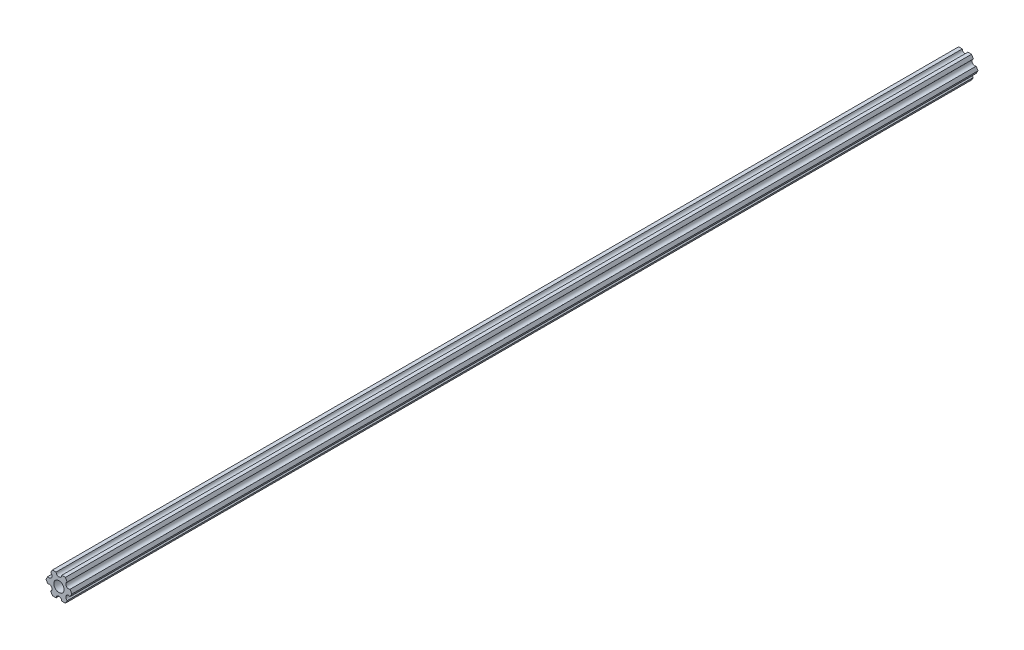
ISO-10303-21;
HEADER;
FILE_DESCRIPTION(('STEP AP214'),'2;1');
FILE_NAME('part.step','',(''),(''),'','','');
FILE_SCHEMA(('AUTOMOTIVE_DESIGN { 1 0 10303 214 1 1 1 1 }'));
ENDSEC;
DATA;
#1=APPLICATION_CONTEXT('core data for automotive mechanical design processes');
#2=APPLICATION_PROTOCOL_DEFINITION('international standard','automotive_design',2000,#1);
#3=PRODUCT_CONTEXT('',#1,'mechanical');
#4=PRODUCT('Part','Part','',(#3));
#5=PRODUCT_RELATED_PRODUCT_CATEGORY('part','',(#4));
#6=PRODUCT_DEFINITION_FORMATION('','',#4);
#7=PRODUCT_DEFINITION_CONTEXT('part definition',#1,'design');
#8=PRODUCT_DEFINITION('design','',#6,#7);
#9=PRODUCT_DEFINITION_SHAPE('','',#8);
#10=(LENGTH_UNIT() NAMED_UNIT(*) SI_UNIT(.MILLI.,.METRE.));
#11=(NAMED_UNIT(*) PLANE_ANGLE_UNIT() SI_UNIT($,.RADIAN.));
#12=(NAMED_UNIT(*) SI_UNIT($,.STERADIAN.) SOLID_ANGLE_UNIT());
#13=UNCERTAINTY_MEASURE_WITH_UNIT(LENGTH_MEASURE(1.E-05),#10,'distance_accuracy_value','');
#14=(GEOMETRIC_REPRESENTATION_CONTEXT(3) GLOBAL_UNCERTAINTY_ASSIGNED_CONTEXT((#13)) GLOBAL_UNIT_ASSIGNED_CONTEXT((#10,
#11,#12)) REPRESENTATION_CONTEXT('',''));
#15=CARTESIAN_POINT('',(0.,0.,0.));
#16=DIRECTION('',(0.,0.,1.));
#17=DIRECTION('',(1.,0.,0.));
#18=AXIS2_PLACEMENT_3D('',#15,#16,#17);
#19=CARTESIAN_POINT('',(5.49926112168156,3.17500033315933,514.35));
#20=DIRECTION('',(0.,0.,1.));
#21=DIRECTION('',(1.,0.,0.));
#22=AXIS2_PLACEMENT_3D('',#19,#20,#21);
#23=PLANE('',#22);
#24=DIRECTION('',(0.499999947533953,0.866025434075723,0.));
#25=VECTOR('',#24,1.);
#26=CARTESIAN_POINT('',(6.29301142309098,-1.80018429024546,514.35));
#27=LINE('',#26,#25);
#28=CARTESIAN_POINT('',(6.29301142309098,-1.80018429024546,514.35));
#29=VERTEX_POINT('',#28);
#30=CARTESIAN_POINT('',(7.33234841870826,4.44212519169686E-07,514.35));
#31=VERTEX_POINT('',#30);
#32=EDGE_CURVE('E229',#29,#31,#27,.T.);
#33=ORIENTED_EDGE('',*,*,#32,.T.);
#34=DIRECTION('',(-0.500000052466056,0.866025373493145,0.));
#35=VECTOR('',#34,1.);
#36=CARTESIAN_POINT('',(7.33234841870826,4.44212519169686E-07,514.35));
#37=LINE('',#36,#35);
#38=CARTESIAN_POINT('',(6.29301120497139,1.80018505273894,514.35));
#39=VERTEX_POINT('',#38);
#40=EDGE_CURVE('E127',#31,#39,#37,.T.);
#41=ORIENTED_EDGE('',*,*,#40,.T.);
#42=CARTESIAN_POINT('',(5.49926112168156,3.17500033315933,514.35));
#43=DIRECTION('',(0.,0.,-1.));
#44=DIRECTION('',(1.,0.,0.));
#45=AXIS2_PLACEMENT_3D('',#42,#43,#44);
#46=CIRCLE('',#45,1.5875);
#47=CARTESIAN_POINT('',(4.70551103839172,4.54981561357972,514.35));
#48=VERTEX_POINT('',#47);
#49=EDGE_CURVE('E274',#39,#48,#46,.T.);
#50=ORIENTED_EDGE('',*,*,#49,.T.);
#51=DIRECTION('',(-0.500000052466046,0.866025373493151,0.));
#52=VECTOR('',#51,1.);
#53=CARTESIAN_POINT('',(4.70551103839172,4.54981561357972,514.35));
#54=LINE('',#53,#52);
#55=CARTESIAN_POINT('',(3.66617382465481,6.35000022210627,514.35));
#56=VERTEX_POINT('',#55);
#57=EDGE_CURVE('E293',#48,#56,#54,.T.);
#58=ORIENTED_EDGE('',*,*,#57,.T.);
#59=DIRECTION('',(-0.999999999999998,-6.05825850611185E-08,0.));
#60=VECTOR('',#59,1.);
#61=CARTESIAN_POINT('',(3.66617382465481,6.35000022210627,514.35));
#62=LINE('',#61,#60);
#63=CARTESIAN_POINT('',(1.58749961530074,6.35000009617482,514.35));
#64=VERTEX_POINT('',#63);
#65=EDGE_CURVE('E290',#56,#64,#62,.T.);
#66=ORIENTED_EDGE('',*,*,#65,.T.);
#67=CARTESIAN_POINT('',(-3.84699260060323E-07,6.35,514.35));
#68=DIRECTION('',(0.,0.,-1.));
#69=DIRECTION('',(1.,0.,0.));
#70=AXIS2_PLACEMENT_3D('',#67,#68,#69);
#71=CIRCLE('',#70,1.5875);
#72=CARTESIAN_POINT('',(-1.58750038469926,6.34999990382518,514.35));
#73=VERTEX_POINT('',#72);
#74=EDGE_CURVE('E292',#64,#73,#71,.T.);
#75=ORIENTED_EDGE('',*,*,#74,.T.);
#76=DIRECTION('',(-0.999999999999998,-6.05825963273174E-08,0.));
#77=VECTOR('',#76,1.);
#78=CARTESIAN_POINT('',(-1.58750038469926,6.34999990382518,514.35));
#79=LINE('',#78,#77);
#80=CARTESIAN_POINT('',(-3.66617459405349,6.3499997778937,514.35));
#81=VERTEX_POINT('',#80);
#82=EDGE_CURVE('E295',#73,#81,#79,.T.);
#83=ORIENTED_EDGE('',*,*,#82,.T.);
#84=DIRECTION('',(-0.499999947533942,-0.866025434075729,0.));
#85=VECTOR('',#84,1.);
#86=CARTESIAN_POINT('',(-3.66617459405349,6.3499997778937,514.35));
#87=LINE('',#86,#85);
#88=CARTESIAN_POINT('',(-4.70551158967065,4.54981504343587,514.35));
#89=VERTEX_POINT('',#88);
#90=EDGE_CURVE('E301',#81,#89,#87,.T.);
#91=ORIENTED_EDGE('',*,*,#90,.T.);
#92=CARTESIAN_POINT('',(-5.49926150638082,3.17499966684067,514.35));
#93=DIRECTION('',(0.,0.,-1.));
#94=DIRECTION('',(1.,0.,0.));
#95=AXIS2_PLACEMENT_3D('',#92,#93,#94);
#96=CIRCLE('',#95,1.5875);
#97=CARTESIAN_POINT('',(-6.29301142309098,1.80018429024547,514.35));
#98=VERTEX_POINT('',#97);
#99=EDGE_CURVE('E303',#89,#98,#96,.T.);
#100=ORIENTED_EDGE('',*,*,#99,.T.);
#101=DIRECTION('',(-0.499999947533951,-0.866025434075724,0.));
#102=VECTOR('',#101,1.);
#103=CARTESIAN_POINT('',(-6.29301142309098,1.80018429024547,514.35));
#104=LINE('',#103,#102);
#105=CARTESIAN_POINT('',(-7.33234841870826,-4.44212523790841E-07,514.35));
#106=VERTEX_POINT('',#105);
#107=EDGE_CURVE('E305',#98,#106,#104,.T.);
#108=ORIENTED_EDGE('',*,*,#107,.T.);
#109=DIRECTION('',(0.500000052466045,-0.866025373493151,0.));
#110=VECTOR('',#109,1.);
#111=CARTESIAN_POINT('',(-7.33234841870826,-4.44212523790841E-07,514.35));
#112=LINE('',#111,#110);
#113=CARTESIAN_POINT('',(-6.29301120497141,-1.80018505273897,514.35));
#114=VERTEX_POINT('',#113);
#115=EDGE_CURVE('E307',#106,#114,#112,.T.);
#116=ORIENTED_EDGE('',*,*,#115,.T.);
#117=CARTESIAN_POINT('',(-5.49926112168156,-3.17500033315934,514.35));
#118=DIRECTION('',(0.,0.,-1.));
#119=DIRECTION('',(1.,0.,0.));
#120=AXIS2_PLACEMENT_3D('',#117,#118,#119);
#121=CIRCLE('',#120,1.5875);
#122=CARTESIAN_POINT('',(-4.70551103839172,-4.54981561357972,514.35));
#123=VERTEX_POINT('',#122);
#124=EDGE_CURVE('E309',#114,#123,#121,.T.);
#125=ORIENTED_EDGE('',*,*,#124,.T.);
#126=DIRECTION('',(0.500000052466045,-0.866025373493151,0.));
#127=VECTOR('',#126,1.);
#128=CARTESIAN_POINT('',(-4.70551103839172,-4.54981561357972,514.35));
#129=LINE('',#128,#127);
#130=CARTESIAN_POINT('',(-3.66617382465481,-6.35000022210628,514.35));
#131=VERTEX_POINT('',#130);
#132=EDGE_CURVE('E311',#123,#131,#129,.T.);
#133=ORIENTED_EDGE('',*,*,#132,.T.);
#134=DIRECTION('',(0.999999999999998,6.05825854783851E-08,0.));
#135=VECTOR('',#134,1.);
#136=CARTESIAN_POINT('',(-3.66617382465481,-6.35000022210628,514.35));
#137=LINE('',#136,#135);
#138=CARTESIAN_POINT('',(-1.58749961530074,-6.35000009617482,514.35));
#139=VERTEX_POINT('',#138);
#140=EDGE_CURVE('E313',#131,#139,#137,.T.);
#141=ORIENTED_EDGE('',*,*,#140,.T.);
#142=CARTESIAN_POINT('',(3.8469926204343E-07,-6.35,514.35));
#143=DIRECTION('',(0.,0.,-1.));
#144=DIRECTION('',(1.,0.,0.));
#145=AXIS2_PLACEMENT_3D('',#142,#143,#144);
#146=CIRCLE('',#145,1.5875);
#147=CARTESIAN_POINT('',(1.58750038469926,-6.34999990382518,514.35));
#148=VERTEX_POINT('',#147);
#149=EDGE_CURVE('E176',#139,#148,#146,.T.);
#150=ORIENTED_EDGE('',*,*,#149,.T.);
#151=DIRECTION('',(0.999999999999998,6.05825721258438E-08,0.));
#152=VECTOR('',#151,1.);
#153=CARTESIAN_POINT('',(1.58750038469926,-6.34999990382518,514.35));
#154=LINE('',#153,#152);
#155=CARTESIAN_POINT('',(3.66617459405346,-6.34999977789375,514.35));
#156=VERTEX_POINT('',#155);
#157=EDGE_CURVE('E170',#148,#156,#154,.T.);
#158=ORIENTED_EDGE('',*,*,#157,.T.);
#159=DIRECTION('',(0.499999947533941,0.86602543407573,0.));
#160=VECTOR('',#159,1.);
#161=CARTESIAN_POINT('',(3.66617459405346,-6.34999977789375,514.35));
#162=LINE('',#161,#160);
#163=CARTESIAN_POINT('',(4.70551158967065,-4.54981504343587,514.35));
#164=VERTEX_POINT('',#163);
#165=EDGE_CURVE('E174',#156,#164,#162,.T.);
#166=ORIENTED_EDGE('',*,*,#165,.T.);
#167=CARTESIAN_POINT('',(5.49926150638082,-3.17499966684067,514.35));
#168=DIRECTION('',(0.,0.,-1.));
#169=DIRECTION('',(1.,0.,0.));
#170=AXIS2_PLACEMENT_3D('',#167,#168,#169);
#171=CIRCLE('',#170,1.58750000000001);
#172=EDGE_CURVE('E54',#164,#29,#171,.T.);
#173=ORIENTED_EDGE('',*,*,#172,.T.);
#174=EDGE_LOOP('',(#33,#41,#50,#58,#66,#75,#83,#91,#100,#108,#116,#125,#133,#141,#150,#158,#166,#173));
#175=FACE_BOUND('',#174,.T.);
#176=CARTESIAN_POINT('',(0.,0.,514.35));
#177=DIRECTION('',(0.,0.,1.));
#178=DIRECTION('',(1.,0.,0.));
#179=AXIS2_PLACEMENT_3D('',#176,#177,#178);
#180=CIRCLE('',#179,2.9337);
#181=CARTESIAN_POINT('',(2.9337,0.,514.35));
#182=VERTEX_POINT('',#181);
#183=EDGE_CURVE('E198',#182,#182,#180,.T.);
#184=ORIENTED_EDGE('',*,*,#183,.F.);
#185=EDGE_LOOP('',(#184));
#186=FACE_BOUND('',#185,.T.);
#187=ADVANCED_FACE('F37',(#175,#186),#23,.T.);
#188=CARTESIAN_POINT('',(5.49926112168156,3.17500033315933,0.));
#189=DIRECTION('',(0.,0.,1.));
#190=DIRECTION('',(1.,0.,0.));
#191=AXIS2_PLACEMENT_3D('',#188,#189,#190);
#192=PLANE('',#191);
#193=DIRECTION('',(0.499999947533953,0.866025434075723,0.));
#194=VECTOR('',#193,1.);
#195=CARTESIAN_POINT('',(6.29301142309098,-1.80018429024546,0.));
#196=LINE('',#195,#194);
#197=CARTESIAN_POINT('',(6.29301142309098,-1.80018429024546,0.));
#198=VERTEX_POINT('',#197);
#199=CARTESIAN_POINT('',(7.33234841870826,4.44212519169686E-07,0.));
#200=VERTEX_POINT('',#199);
#201=EDGE_CURVE('E194',#198,#200,#196,.T.);
#202=ORIENTED_EDGE('',*,*,#201,.F.);
#203=CARTESIAN_POINT('',(5.49926150638082,-3.17499966684067,0.));
#204=DIRECTION('',(0.,0.,-1.));
#205=DIRECTION('',(1.,0.,0.));
#206=AXIS2_PLACEMENT_3D('',#203,#204,#205);
#207=CIRCLE('',#206,1.58750000000001);
#208=CARTESIAN_POINT('',(4.70551158967065,-4.54981504343587,0.));
#209=VERTEX_POINT('',#208);
#210=EDGE_CURVE('E119',#209,#198,#207,.T.);
#211=ORIENTED_EDGE('',*,*,#210,.F.);
#212=DIRECTION('',(0.499999947533941,0.86602543407573,0.));
#213=VECTOR('',#212,1.);
#214=CARTESIAN_POINT('',(3.66617459405346,-6.34999977789375,0.));
#215=LINE('',#214,#213);
#216=CARTESIAN_POINT('',(3.66617459405346,-6.34999977789375,0.));
#217=VERTEX_POINT('',#216);
#218=EDGE_CURVE('E113',#217,#209,#215,.T.);
#219=ORIENTED_EDGE('',*,*,#218,.F.);
#220=DIRECTION('',(0.999999999999998,6.05825721258438E-08,0.));
#221=VECTOR('',#220,1.);
#222=CARTESIAN_POINT('',(1.58750038469926,-6.34999990382518,0.));
#223=LINE('',#222,#221);
#224=CARTESIAN_POINT('',(1.58750038469926,-6.34999990382518,0.));
#225=VERTEX_POINT('',#224);
#226=EDGE_CURVE('E184',#225,#217,#223,.T.);
#227=ORIENTED_EDGE('',*,*,#226,.F.);
#228=CARTESIAN_POINT('',(3.8469926204343E-07,-6.35,0.));
#229=DIRECTION('',(0.,0.,-1.));
#230=DIRECTION('',(1.,0.,0.));
#231=AXIS2_PLACEMENT_3D('',#228,#229,#230);
#232=CIRCLE('',#231,1.5875);
#233=CARTESIAN_POINT('',(-1.58749961530074,-6.35000009617482,0.));
#234=VERTEX_POINT('',#233);
#235=EDGE_CURVE('E224',#234,#225,#232,.T.);
#236=ORIENTED_EDGE('',*,*,#235,.F.);
#237=DIRECTION('',(0.999999999999998,6.05825854783851E-08,0.));
#238=VECTOR('',#237,1.);
#239=CARTESIAN_POINT('',(-3.66617382465481,-6.35000022210628,0.));
#240=LINE('',#239,#238);
#241=CARTESIAN_POINT('',(-3.66617382465481,-6.35000022210628,0.));
#242=VERTEX_POINT('',#241);
#243=EDGE_CURVE('E222',#242,#234,#240,.T.);
#244=ORIENTED_EDGE('',*,*,#243,.F.);
#245=DIRECTION('',(0.500000052466045,-0.866025373493151,0.));
#246=VECTOR('',#245,1.);
#247=CARTESIAN_POINT('',(-4.70551103839172,-4.54981561357972,0.));
#248=LINE('',#247,#246);
#249=CARTESIAN_POINT('',(-4.70551103839172,-4.54981561357972,0.));
#250=VERTEX_POINT('',#249);
#251=EDGE_CURVE('E220',#250,#242,#248,.T.);
#252=ORIENTED_EDGE('',*,*,#251,.F.);
#253=CARTESIAN_POINT('',(-5.49926112168156,-3.17500033315934,0.));
#254=DIRECTION('',(0.,0.,-1.));
#255=DIRECTION('',(1.,0.,0.));
#256=AXIS2_PLACEMENT_3D('',#253,#254,#255);
#257=CIRCLE('',#256,1.5875);
#258=CARTESIAN_POINT('',(-6.29301120497141,-1.80018505273897,0.));
#259=VERTEX_POINT('',#258);
#260=EDGE_CURVE('E218',#259,#250,#257,.T.);
#261=ORIENTED_EDGE('',*,*,#260,.F.);
#262=DIRECTION('',(0.500000052466045,-0.866025373493151,0.));
#263=VECTOR('',#262,1.);
#264=CARTESIAN_POINT('',(-7.33234841870826,-4.44212523790841E-07,0.));
#265=LINE('',#264,#263);
#266=CARTESIAN_POINT('',(-7.33234841870826,-4.44212523790841E-07,0.));
#267=VERTEX_POINT('',#266);
#268=EDGE_CURVE('E216',#267,#259,#265,.T.);
#269=ORIENTED_EDGE('',*,*,#268,.F.);
#270=DIRECTION('',(-0.499999947533951,-0.866025434075724,0.));
#271=VECTOR('',#270,1.);
#272=CARTESIAN_POINT('',(-6.29301142309098,1.80018429024547,0.));
#273=LINE('',#272,#271);
#274=CARTESIAN_POINT('',(-6.29301142309098,1.80018429024547,0.));
#275=VERTEX_POINT('',#274);
#276=EDGE_CURVE('E214',#275,#267,#273,.T.);
#277=ORIENTED_EDGE('',*,*,#276,.F.);
#278=CARTESIAN_POINT('',(-5.49926150638082,3.17499966684067,0.));
#279=DIRECTION('',(0.,0.,-1.));
#280=DIRECTION('',(1.,0.,0.));
#281=AXIS2_PLACEMENT_3D('',#278,#279,#280);
#282=CIRCLE('',#281,1.5875);
#283=CARTESIAN_POINT('',(-4.70551158967065,4.54981504343587,0.));
#284=VERTEX_POINT('',#283);
#285=EDGE_CURVE('E212',#284,#275,#282,.T.);
#286=ORIENTED_EDGE('',*,*,#285,.F.);
#287=DIRECTION('',(-0.499999947533942,-0.866025434075729,0.));
#288=VECTOR('',#287,1.);
#289=CARTESIAN_POINT('',(-3.66617459405349,6.3499997778937,0.));
#290=LINE('',#289,#288);
#291=CARTESIAN_POINT('',(-3.66617459405349,6.3499997778937,0.));
#292=VERTEX_POINT('',#291);
#293=EDGE_CURVE('E210',#292,#284,#290,.T.);
#294=ORIENTED_EDGE('',*,*,#293,.F.);
#295=DIRECTION('',(-0.999999999999998,-6.05825963273174E-08,0.));
#296=VECTOR('',#295,1.);
#297=CARTESIAN_POINT('',(-1.58750038469926,6.34999990382518,0.));
#298=LINE('',#297,#296);
#299=CARTESIAN_POINT('',(-1.58750038469926,6.34999990382518,0.));
#300=VERTEX_POINT('',#299);
#301=EDGE_CURVE('E208',#300,#292,#298,.T.);
#302=ORIENTED_EDGE('',*,*,#301,.F.);
#303=CARTESIAN_POINT('',(-3.84699260060323E-07,6.35,0.));
#304=DIRECTION('',(0.,0.,-1.));
#305=DIRECTION('',(1.,0.,0.));
#306=AXIS2_PLACEMENT_3D('',#303,#304,#305);
#307=CIRCLE('',#306,1.5875);
#308=CARTESIAN_POINT('',(1.58749961530074,6.35000009617482,0.));
#309=VERTEX_POINT('',#308);
#310=EDGE_CURVE('E206',#309,#300,#307,.T.);
#311=ORIENTED_EDGE('',*,*,#310,.F.);
#312=DIRECTION('',(-0.999999999999998,-6.05825850611185E-08,0.));
#313=VECTOR('',#312,1.);
#314=CARTESIAN_POINT('',(3.66617382465481,6.35000022210627,0.));
#315=LINE('',#314,#313);
#316=CARTESIAN_POINT('',(3.66617382465481,6.35000022210627,0.));
#317=VERTEX_POINT('',#316);
#318=EDGE_CURVE('E204',#317,#309,#315,.T.);
#319=ORIENTED_EDGE('',*,*,#318,.F.);
#320=DIRECTION('',(-0.500000052466046,0.866025373493151,0.));
#321=VECTOR('',#320,1.);
#322=CARTESIAN_POINT('',(4.70551103839172,4.54981561357972,0.));
#323=LINE('',#322,#321);
#324=CARTESIAN_POINT('',(4.70551103839172,4.54981561357972,0.));
#325=VERTEX_POINT('',#324);
#326=EDGE_CURVE('E202',#325,#317,#323,.T.);
#327=ORIENTED_EDGE('',*,*,#326,.F.);
#328=CARTESIAN_POINT('',(5.49926112168156,3.17500033315933,0.));
#329=DIRECTION('',(0.,0.,-1.));
#330=DIRECTION('',(1.,0.,0.));
#331=AXIS2_PLACEMENT_3D('',#328,#329,#330);
#332=CIRCLE('',#331,1.5875);
#333=CARTESIAN_POINT('',(6.29301120497139,1.80018505273894,0.));
#334=VERTEX_POINT('',#333);
#335=EDGE_CURVE('E200',#334,#325,#332,.T.);
#336=ORIENTED_EDGE('',*,*,#335,.F.);
#337=DIRECTION('',(-0.500000052466056,0.866025373493145,0.));
#338=VECTOR('',#337,1.);
#339=CARTESIAN_POINT('',(7.33234841870826,4.44212519169686E-07,0.));
#340=LINE('',#339,#338);
#341=EDGE_CURVE('E197',#200,#334,#340,.T.);
#342=ORIENTED_EDGE('',*,*,#341,.F.);
#343=EDGE_LOOP('',(#202,#211,#219,#227,#236,#244,#252,#261,#269,#277,#286,#294,#302,#311,#319,
#327,#336,#342));
#344=FACE_BOUND('',#343,.T.);
#345=CARTESIAN_POINT('',(0.,0.,0.));
#346=DIRECTION('',(0.,0.,1.));
#347=DIRECTION('',(1.,0.,0.));
#348=AXIS2_PLACEMENT_3D('',#345,#346,#347);
#349=CIRCLE('',#348,2.9337);
#350=CARTESIAN_POINT('',(2.9337,0.,0.));
#351=VERTEX_POINT('',#350);
#352=EDGE_CURVE('E538',#351,#351,#349,.T.);
#353=ORIENTED_EDGE('',*,*,#352,.T.);
#354=EDGE_LOOP('',(#353));
#355=FACE_BOUND('',#354,.T.);
#356=ADVANCED_FACE('F278',(#344,#355),#192,.F.);
#357=CARTESIAN_POINT('',(6.29301142309098,-1.80018429024546,514.35));
#358=DIRECTION('',(-0.866025434075723,0.499999947533953,0.));
#359=DIRECTION('',(-0.499999947533953,-0.866025434075723,0.));
#360=AXIS2_PLACEMENT_3D('',#357,#358,#359);
#361=PLANE('',#360);
#362=ORIENTED_EDGE('',*,*,#201,.T.);
#363=DIRECTION('',(0.,0.,-1.));
#364=VECTOR('',#363,1.);
#365=CARTESIAN_POINT('',(7.33234841870826,4.44212519169686E-07,514.35));
#366=LINE('',#365,#364);
#367=EDGE_CURVE('E11',#31,#200,#366,.T.);
#368=ORIENTED_EDGE('',*,*,#367,.F.);
#369=ORIENTED_EDGE('',*,*,#32,.F.);
#370=DIRECTION('',(0.,0.,-1.));
#371=VECTOR('',#370,1.);
#372=CARTESIAN_POINT('',(6.29301142309098,-1.80018429024546,514.35));
#373=LINE('',#372,#371);
#374=EDGE_CURVE('E190',#29,#198,#373,.T.);
#375=ORIENTED_EDGE('',*,*,#374,.T.);
#376=EDGE_LOOP('',(#362,#368,#369,#375));
#377=FACE_BOUND('',#376,.T.);
#378=ADVANCED_FACE('F39',(#377),#361,.F.);
#379=CARTESIAN_POINT('',(7.33234841870826,4.44212519169686E-07,514.35));
#380=DIRECTION('',(-0.866025373493145,-0.500000052466056,0.));
#381=DIRECTION('',(0.500000052466056,-0.866025373493145,0.));
#382=AXIS2_PLACEMENT_3D('',#379,#380,#381);
#383=PLANE('',#382);
#384=ORIENTED_EDGE('',*,*,#341,.T.);
#385=DIRECTION('',(0.,0.,-1.));
#386=VECTOR('',#385,1.);
#387=CARTESIAN_POINT('',(6.29301120497139,1.80018505273894,514.35));
#388=LINE('',#387,#386);
#389=EDGE_CURVE('E46',#39,#334,#388,.T.);
#390=ORIENTED_EDGE('',*,*,#389,.F.);
#391=ORIENTED_EDGE('',*,*,#40,.F.);
#392=ORIENTED_EDGE('',*,*,#367,.T.);
#393=EDGE_LOOP('',(#384,#390,#391,#392));
#394=FACE_BOUND('',#393,.T.);
#395=ADVANCED_FACE('F347',(#394),#383,.F.);
#396=CARTESIAN_POINT('',(5.49926112168156,3.17500033315933,514.35));
#397=DIRECTION('',(0.,0.,-1.));
#398=DIRECTION('',(-1.,0.,0.));
#399=AXIS2_PLACEMENT_3D('',#396,#397,#398);
#400=CYLINDRICAL_SURFACE('',#399,1.5875);
#401=ORIENTED_EDGE('',*,*,#335,.T.);
#402=DIRECTION('',(0.,0.,-1.));
#403=VECTOR('',#402,1.);
#404=CARTESIAN_POINT('',(4.70551103839172,4.54981561357972,514.35));
#405=LINE('',#404,#403);
#406=EDGE_CURVE('E266',#48,#325,#405,.T.);
#407=ORIENTED_EDGE('',*,*,#406,.F.);
#408=ORIENTED_EDGE('',*,*,#49,.F.);
#409=ORIENTED_EDGE('',*,*,#389,.T.);
#410=EDGE_LOOP('',(#401,#407,#408,#409));
#411=FACE_BOUND('',#410,.T.);
#412=ADVANCED_FACE('F272',(#411),#400,.F.);
#413=CARTESIAN_POINT('',(4.70551103839172,4.54981561357972,514.35));
#414=DIRECTION('',(-0.866025373493151,-0.500000052466046,0.));
#415=DIRECTION('',(0.500000052466046,-0.866025373493151,0.));
#416=AXIS2_PLACEMENT_3D('',#413,#414,#415);
#417=PLANE('',#416);
#418=ORIENTED_EDGE('',*,*,#326,.T.);
#419=DIRECTION('',(0.,0.,-1.));
#420=VECTOR('',#419,1.);
#421=CARTESIAN_POINT('',(3.66617382465481,6.35000022210627,514.35));
#422=LINE('',#421,#420);
#423=EDGE_CURVE('E263',#56,#317,#422,.T.);
#424=ORIENTED_EDGE('',*,*,#423,.F.);
#425=ORIENTED_EDGE('',*,*,#57,.F.);
#426=ORIENTED_EDGE('',*,*,#406,.T.);
#427=EDGE_LOOP('',(#418,#424,#425,#426));
#428=FACE_BOUND('',#427,.T.);
#429=ADVANCED_FACE('F284',(#428),#417,.F.);
#430=CARTESIAN_POINT('',(3.66617382465481,6.35000022210627,514.35));
#431=DIRECTION('',(6.05825850611185E-08,-0.999999999999998,0.));
#432=DIRECTION('',(0.999999999999998,6.05825850611185E-08,0.));
#433=AXIS2_PLACEMENT_3D('',#430,#431,#432);
#434=PLANE('',#433);
#435=ORIENTED_EDGE('',*,*,#318,.T.);
#436=DIRECTION('',(0.,0.,-1.));
#437=VECTOR('',#436,1.);
#438=CARTESIAN_POINT('',(1.58749961530074,6.35000009617482,514.35));
#439=LINE('',#438,#437);
#440=EDGE_CURVE('E260',#64,#309,#439,.T.);
#441=ORIENTED_EDGE('',*,*,#440,.F.);
#442=ORIENTED_EDGE('',*,*,#65,.F.);
#443=ORIENTED_EDGE('',*,*,#423,.T.);
#444=EDGE_LOOP('',(#435,#441,#442,#443));
#445=FACE_BOUND('',#444,.T.);
#446=ADVANCED_FACE('F288',(#445),#434,.F.);
#447=CARTESIAN_POINT('',(-3.84699260060323E-07,6.35,514.35));
#448=DIRECTION('',(0.,0.,-1.));
#449=DIRECTION('',(-1.,0.,0.));
#450=AXIS2_PLACEMENT_3D('',#447,#448,#449);
#451=CYLINDRICAL_SURFACE('',#450,1.5875);
#452=ORIENTED_EDGE('',*,*,#310,.T.);
#453=DIRECTION('',(0.,0.,-1.));
#454=VECTOR('',#453,1.);
#455=CARTESIAN_POINT('',(-1.58750038469926,6.34999990382518,514.35));
#456=LINE('',#455,#454);
#457=EDGE_CURVE('E257',#73,#300,#456,.T.);
#458=ORIENTED_EDGE('',*,*,#457,.F.);
#459=ORIENTED_EDGE('',*,*,#74,.F.);
#460=ORIENTED_EDGE('',*,*,#440,.T.);
#461=EDGE_LOOP('',(#452,#458,#459,#460));
#462=FACE_BOUND('',#461,.T.);
#463=ADVANCED_FACE('F360',(#462),#451,.F.);
#464=CARTESIAN_POINT('',(-1.58750038469926,6.34999990382518,514.35));
#465=DIRECTION('',(6.05825963273174E-08,-0.999999999999998,0.));
#466=DIRECTION('',(0.999999999999998,6.05825963273174E-08,0.));
#467=AXIS2_PLACEMENT_3D('',#464,#465,#466);
#468=PLANE('',#467);
#469=ORIENTED_EDGE('',*,*,#301,.T.);
#470=DIRECTION('',(0.,0.,-1.));
#471=VECTOR('',#470,1.);
#472=CARTESIAN_POINT('',(-3.66617459405349,6.3499997778937,514.35));
#473=LINE('',#472,#471);
#474=EDGE_CURVE('E254',#81,#292,#473,.T.);
#475=ORIENTED_EDGE('',*,*,#474,.F.);
#476=ORIENTED_EDGE('',*,*,#82,.F.);
#477=ORIENTED_EDGE('',*,*,#457,.T.);
#478=EDGE_LOOP('',(#469,#475,#476,#477));
#479=FACE_BOUND('',#478,.T.);
#480=ADVANCED_FACE('F363',(#479),#468,.F.);
#481=CARTESIAN_POINT('',(-3.66617459405349,6.3499997778937,514.35));
#482=DIRECTION('',(0.866025434075729,-0.499999947533942,0.));
#483=DIRECTION('',(0.499999947533943,0.866025434075729,0.));
#484=AXIS2_PLACEMENT_3D('',#481,#482,#483);
#485=PLANE('',#484);
#486=ORIENTED_EDGE('',*,*,#293,.T.);
#487=DIRECTION('',(0.,0.,-1.));
#488=VECTOR('',#487,1.);
#489=CARTESIAN_POINT('',(-4.70551158967065,4.54981504343587,514.35));
#490=LINE('',#489,#488);
#491=EDGE_CURVE('E251',#89,#284,#490,.T.);
#492=ORIENTED_EDGE('',*,*,#491,.F.);
#493=ORIENTED_EDGE('',*,*,#90,.F.);
#494=ORIENTED_EDGE('',*,*,#474,.T.);
#495=EDGE_LOOP('',(#486,#492,#493,#494));
#496=FACE_BOUND('',#495,.T.);
#497=ADVANCED_FACE('F367',(#496),#485,.F.);
#498=CARTESIAN_POINT('',(-5.49926150638082,3.17499966684067,514.35));
#499=DIRECTION('',(0.,0.,-1.));
#500=DIRECTION('',(-1.,0.,0.));
#501=AXIS2_PLACEMENT_3D('',#498,#499,#500);
#502=CYLINDRICAL_SURFACE('',#501,1.5875);
#503=ORIENTED_EDGE('',*,*,#285,.T.);
#504=DIRECTION('',(0.,0.,-1.));
#505=VECTOR('',#504,1.);
#506=CARTESIAN_POINT('',(-6.29301142309098,1.80018429024547,514.35));
#507=LINE('',#506,#505);
#508=EDGE_CURVE('E248',#98,#275,#507,.T.);
#509=ORIENTED_EDGE('',*,*,#508,.F.);
#510=ORIENTED_EDGE('',*,*,#99,.F.);
#511=ORIENTED_EDGE('',*,*,#491,.T.);
#512=EDGE_LOOP('',(#503,#509,#510,#511));
#513=FACE_BOUND('',#512,.T.);
#514=ADVANCED_FACE('F371',(#513),#502,.F.);
#515=CARTESIAN_POINT('',(-6.29301142309098,1.80018429024547,514.35));
#516=DIRECTION('',(0.866025434075724,-0.499999947533951,0.));
#517=DIRECTION('',(0.499999947533951,0.866025434075724,0.));
#518=AXIS2_PLACEMENT_3D('',#515,#516,#517);
#519=PLANE('',#518);
#520=ORIENTED_EDGE('',*,*,#276,.T.);
#521=DIRECTION('',(0.,0.,-1.));
#522=VECTOR('',#521,1.);
#523=CARTESIAN_POINT('',(-7.33234841870826,-4.44212523790841E-07,514.35));
#524=LINE('',#523,#522);
#525=EDGE_CURVE('E245',#106,#267,#524,.T.);
#526=ORIENTED_EDGE('',*,*,#525,.F.);
#527=ORIENTED_EDGE('',*,*,#107,.F.);
#528=ORIENTED_EDGE('',*,*,#508,.T.);
#529=EDGE_LOOP('',(#520,#526,#527,#528));
#530=FACE_BOUND('',#529,.T.);
#531=ADVANCED_FACE('F375',(#530),#519,.F.);
#532=CARTESIAN_POINT('',(-7.33234841870826,-4.44212523790841E-07,514.35));
#533=DIRECTION('',(0.866025373493151,0.500000052466045,0.));
#534=DIRECTION('',(-0.500000052466045,0.866025373493151,0.));
#535=AXIS2_PLACEMENT_3D('',#532,#533,#534);
#536=PLANE('',#535);
#537=ORIENTED_EDGE('',*,*,#268,.T.);
#538=DIRECTION('',(0.,0.,-1.));
#539=VECTOR('',#538,1.);
#540=CARTESIAN_POINT('',(-6.29301120497141,-1.80018505273897,514.35));
#541=LINE('',#540,#539);
#542=EDGE_CURVE('E242',#114,#259,#541,.T.);
#543=ORIENTED_EDGE('',*,*,#542,.F.);
#544=ORIENTED_EDGE('',*,*,#115,.F.);
#545=ORIENTED_EDGE('',*,*,#525,.T.);
#546=EDGE_LOOP('',(#537,#543,#544,#545));
#547=FACE_BOUND('',#546,.T.);
#548=ADVANCED_FACE('F379',(#547),#536,.F.);
#549=CARTESIAN_POINT('',(-5.49926112168156,-3.17500033315934,514.35));
#550=DIRECTION('',(0.,0.,-1.));
#551=DIRECTION('',(-1.,0.,0.));
#552=AXIS2_PLACEMENT_3D('',#549,#550,#551);
#553=CYLINDRICAL_SURFACE('',#552,1.5875);
#554=ORIENTED_EDGE('',*,*,#260,.T.);
#555=DIRECTION('',(0.,0.,-1.));
#556=VECTOR('',#555,1.);
#557=CARTESIAN_POINT('',(-4.70551103839172,-4.54981561357972,514.35));
#558=LINE('',#557,#556);
#559=EDGE_CURVE('E239',#123,#250,#558,.T.);
#560=ORIENTED_EDGE('',*,*,#559,.F.);
#561=ORIENTED_EDGE('',*,*,#124,.F.);
#562=ORIENTED_EDGE('',*,*,#542,.T.);
#563=EDGE_LOOP('',(#554,#560,#561,#562));
#564=FACE_BOUND('',#563,.T.);
#565=ADVANCED_FACE('F383',(#564),#553,.F.);
#566=CARTESIAN_POINT('',(-4.70551103839172,-4.54981561357972,514.35));
#567=DIRECTION('',(0.866025373493151,0.500000052466045,0.));
#568=DIRECTION('',(-0.500000052466045,0.866025373493152,0.));
#569=AXIS2_PLACEMENT_3D('',#566,#567,#568);
#570=PLANE('',#569);
#571=ORIENTED_EDGE('',*,*,#251,.T.);
#572=DIRECTION('',(0.,0.,-1.));
#573=VECTOR('',#572,1.);
#574=CARTESIAN_POINT('',(-3.66617382465481,-6.35000022210628,514.35));
#575=LINE('',#574,#573);
#576=EDGE_CURVE('E236',#131,#242,#575,.T.);
#577=ORIENTED_EDGE('',*,*,#576,.F.);
#578=ORIENTED_EDGE('',*,*,#132,.F.);
#579=ORIENTED_EDGE('',*,*,#559,.T.);
#580=EDGE_LOOP('',(#571,#577,#578,#579));
#581=FACE_BOUND('',#580,.T.);
#582=ADVANCED_FACE('F387',(#581),#570,.F.);
#583=CARTESIAN_POINT('',(-3.66617382465481,-6.35000022210628,514.35));
#584=DIRECTION('',(-6.05825854783851E-08,0.999999999999998,0.));
#585=DIRECTION('',(-0.999999999999998,-6.05825854783851E-08,0.));
#586=AXIS2_PLACEMENT_3D('',#583,#584,#585);
#587=PLANE('',#586);
#588=ORIENTED_EDGE('',*,*,#243,.T.);
#589=DIRECTION('',(0.,0.,-1.));
#590=VECTOR('',#589,1.);
#591=CARTESIAN_POINT('',(-1.58749961530074,-6.35000009617482,514.35));
#592=LINE('',#591,#590);
#593=EDGE_CURVE('E233',#139,#234,#592,.T.);
#594=ORIENTED_EDGE('',*,*,#593,.F.);
#595=ORIENTED_EDGE('',*,*,#140,.F.);
#596=ORIENTED_EDGE('',*,*,#576,.T.);
#597=EDGE_LOOP('',(#588,#594,#595,#596));
#598=FACE_BOUND('',#597,.T.);
#599=ADVANCED_FACE('F319',(#598),#587,.F.);
#600=CARTESIAN_POINT('',(3.8469926204343E-07,-6.35,514.35));
#601=DIRECTION('',(0.,0.,-1.));
#602=DIRECTION('',(-1.,0.,0.));
#603=AXIS2_PLACEMENT_3D('',#600,#601,#602);
#604=CYLINDRICAL_SURFACE('',#603,1.5875);
#605=ORIENTED_EDGE('',*,*,#235,.T.);
#606=DIRECTION('',(0.,0.,-1.));
#607=VECTOR('',#606,1.);
#608=CARTESIAN_POINT('',(1.58750038469926,-6.34999990382518,514.35));
#609=LINE('',#608,#607);
#610=EDGE_CURVE('E185',#148,#225,#609,.T.);
#611=ORIENTED_EDGE('',*,*,#610,.F.);
#612=ORIENTED_EDGE('',*,*,#149,.F.);
#613=ORIENTED_EDGE('',*,*,#593,.T.);
#614=EDGE_LOOP('',(#605,#611,#612,#613));
#615=FACE_BOUND('',#614,.T.);
#616=ADVANCED_FACE('F323',(#615),#604,.F.);
#617=CARTESIAN_POINT('',(1.58750038469926,-6.34999990382518,514.35));
#618=DIRECTION('',(-6.05825721258438E-08,0.999999999999998,0.));
#619=DIRECTION('',(-0.999999999999998,-6.05825721258438E-08,0.));
#620=AXIS2_PLACEMENT_3D('',#617,#618,#619);
#621=PLANE('',#620);
#622=ORIENTED_EDGE('',*,*,#226,.T.);
#623=DIRECTION('',(0.,0.,-1.));
#624=VECTOR('',#623,1.);
#625=CARTESIAN_POINT('',(3.66617459405346,-6.34999977789375,514.35));
#626=LINE('',#625,#624);
#627=EDGE_CURVE('E181',#156,#217,#626,.T.);
#628=ORIENTED_EDGE('',*,*,#627,.F.);
#629=ORIENTED_EDGE('',*,*,#157,.F.);
#630=ORIENTED_EDGE('',*,*,#610,.T.);
#631=EDGE_LOOP('',(#622,#628,#629,#630));
#632=FACE_BOUND('',#631,.T.);
#633=ADVANCED_FACE('F182',(#632),#621,.F.);
#634=CARTESIAN_POINT('',(3.66617459405346,-6.34999977789375,514.35));
#635=DIRECTION('',(-0.86602543407573,0.499999947533941,0.));
#636=DIRECTION('',(-0.499999947533941,-0.86602543407573,0.));
#637=AXIS2_PLACEMENT_3D('',#634,#635,#636);
#638=PLANE('',#637);
#639=ORIENTED_EDGE('',*,*,#218,.T.);
#640=DIRECTION('',(0.,0.,-1.));
#641=VECTOR('',#640,1.);
#642=CARTESIAN_POINT('',(4.70551158967065,-4.54981504343587,514.35));
#643=LINE('',#642,#641);
#644=EDGE_CURVE('E186',#164,#209,#643,.T.);
#645=ORIENTED_EDGE('',*,*,#644,.F.);
#646=ORIENTED_EDGE('',*,*,#165,.F.);
#647=ORIENTED_EDGE('',*,*,#627,.T.);
#648=EDGE_LOOP('',(#639,#645,#646,#647));
#649=FACE_BOUND('',#648,.T.);
#650=ADVANCED_FACE('F188',(#649),#638,.F.);
#651=CARTESIAN_POINT('',(5.49926150638082,-3.17499966684067,514.35));
#652=DIRECTION('',(0.,0.,-1.));
#653=DIRECTION('',(-1.,0.,0.));
#654=AXIS2_PLACEMENT_3D('',#651,#652,#653);
#655=CYLINDRICAL_SURFACE('',#654,1.58750000000001);
#656=ORIENTED_EDGE('',*,*,#210,.T.);
#657=ORIENTED_EDGE('',*,*,#374,.F.);
#658=ORIENTED_EDGE('',*,*,#172,.F.);
#659=ORIENTED_EDGE('',*,*,#644,.T.);
#660=EDGE_LOOP('',(#656,#657,#658,#659));
#661=FACE_BOUND('',#660,.T.);
#662=ADVANCED_FACE('F327',(#661),#655,.F.);
#663=CARTESIAN_POINT('',(0.,0.,514.35));
#664=DIRECTION('',(0.,0.,-1.));
#665=DIRECTION('',(-1.,0.,0.));
#666=AXIS2_PLACEMENT_3D('',#663,#664,#665);
#667=CYLINDRICAL_SURFACE('',#666,2.9337);
#668=ORIENTED_EDGE('',*,*,#183,.T.);
#669=EDGE_LOOP('',(#668));
#670=FACE_BOUND('',#669,.T.);
#671=ORIENTED_EDGE('',*,*,#352,.F.);
#672=EDGE_LOOP('',(#671));
#673=FACE_BOUND('',#672,.T.);
#674=ADVANCED_FACE('F329',(#670,#673),#667,.F.);
#675=CLOSED_SHELL('',(#187,#356,#378,#395,#412,#429,#446,#463,#480,#497,#514,#531,#548,#565,
#582,#599,#616,#633,#650,#662,#674));
#676=MANIFOLD_SOLID_BREP('B2',#675);
#677=ADVANCED_BREP_SHAPE_REPRESENTATION('',(#18,#676),#14);
#678=SHAPE_DEFINITION_REPRESENTATION(#9,#677);
ENDSEC;
END-ISO-10303-21;
